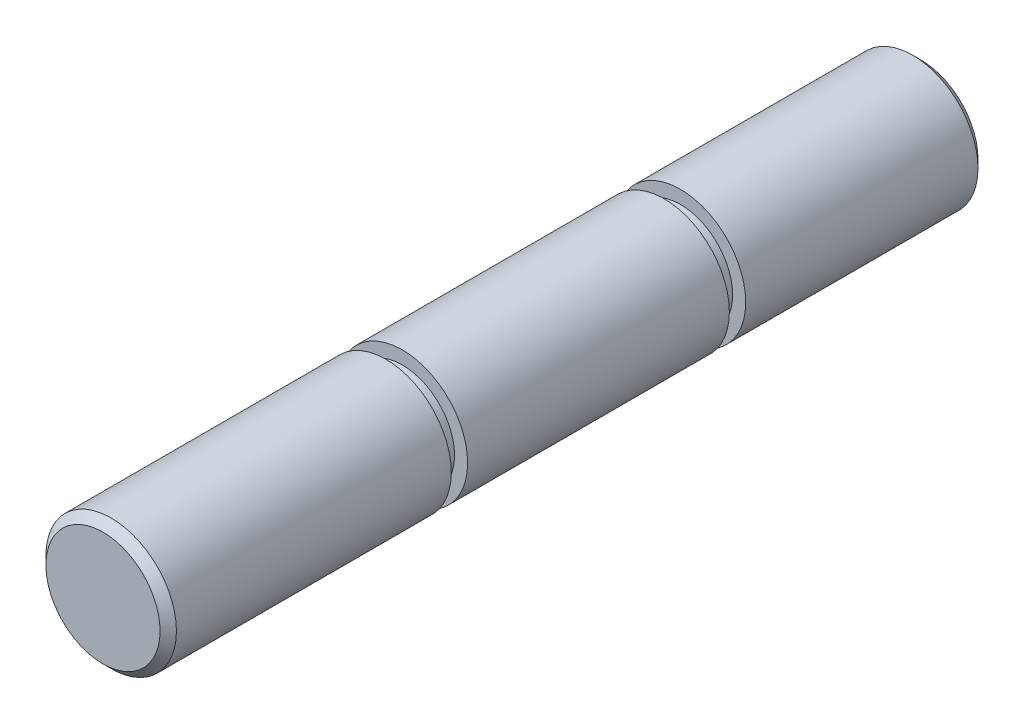
ISO-10303-21;
HEADER;
FILE_DESCRIPTION(('STEP AP214'),'2;1');
FILE_NAME('part.step','',(''),(''),'','','');
FILE_SCHEMA(('AUTOMOTIVE_DESIGN { 1 0 10303 214 1 1 1 1 }'));
ENDSEC;
DATA;
#1=APPLICATION_CONTEXT('core data for automotive mechanical design processes');
#2=APPLICATION_PROTOCOL_DEFINITION('international standard','automotive_design',2000,#1);
#3=PRODUCT_CONTEXT('',#1,'mechanical');
#4=PRODUCT('Part','Part','',(#3));
#5=PRODUCT_RELATED_PRODUCT_CATEGORY('part','',(#4));
#6=PRODUCT_DEFINITION_FORMATION('','',#4);
#7=PRODUCT_DEFINITION_CONTEXT('part definition',#1,'design');
#8=PRODUCT_DEFINITION('design','',#6,#7);
#9=PRODUCT_DEFINITION_SHAPE('','',#8);
#10=(LENGTH_UNIT() NAMED_UNIT(*) SI_UNIT(.MILLI.,.METRE.));
#11=(NAMED_UNIT(*) PLANE_ANGLE_UNIT() SI_UNIT($,.RADIAN.));
#12=(NAMED_UNIT(*) SI_UNIT($,.STERADIAN.) SOLID_ANGLE_UNIT());
#13=UNCERTAINTY_MEASURE_WITH_UNIT(LENGTH_MEASURE(1.E-05),#10,'distance_accuracy_value','');
#14=(GEOMETRIC_REPRESENTATION_CONTEXT(3) GLOBAL_UNCERTAINTY_ASSIGNED_CONTEXT((#13)) GLOBAL_UNIT_ASSIGNED_CONTEXT((#10,
#11,#12)) REPRESENTATION_CONTEXT('',''));
#15=CARTESIAN_POINT('',(0.,0.,0.));
#16=DIRECTION('',(0.,0.,1.));
#17=DIRECTION('',(1.,0.,0.));
#18=AXIS2_PLACEMENT_3D('',#15,#16,#17);
#19=CARTESIAN_POINT('',(0.,0.,50.));
#20=DIRECTION('',(0.,0.,-1.));
#21=DIRECTION('',(-1.,0.,0.));
#22=AXIS2_PLACEMENT_3D('',#19,#20,#21);
#23=CYLINDRICAL_SURFACE('',#22,3.99);
#24=CARTESIAN_POINT('',(0.,0.,0.499999999999994));
#25=DIRECTION('',(0.,0.,1.));
#26=DIRECTION('',(1.,0.,0.));
#27=AXIS2_PLACEMENT_3D('',#24,#25,#26);
#28=CIRCLE('',#27,3.99);
#29=CARTESIAN_POINT('',(3.99,0.,0.499999999999994));
#30=VERTEX_POINT('',#29);
#31=EDGE_CURVE('E45',#30,#30,#28,.T.);
#32=ORIENTED_EDGE('',*,*,#31,.T.);
#33=EDGE_LOOP('',(#32));
#34=FACE_BOUND('',#33,.T.);
#35=CARTESIAN_POINT('',(0.,0.,14.7));
#36=DIRECTION('',(0.,0.,1.));
#37=DIRECTION('',(1.,0.,0.));
#38=AXIS2_PLACEMENT_3D('',#35,#36,#37);
#39=CIRCLE('',#38,3.99);
#40=CARTESIAN_POINT('',(3.99,0.,14.7));
#41=VERTEX_POINT('',#40);
#42=EDGE_CURVE('E66',#41,#41,#39,.T.);
#43=ORIENTED_EDGE('',*,*,#42,.F.);
#44=EDGE_LOOP('',(#43));
#45=FACE_BOUND('',#44,.T.);
#46=ADVANCED_FACE('F37',(#34,#45),#23,.T.);
#47=CARTESIAN_POINT('',(0.,0.,0.));
#48=DIRECTION('',(0.,0.,1.));
#49=DIRECTION('',(1.,0.,0.));
#50=AXIS2_PLACEMENT_3D('',#47,#48,#49);
#51=PLANE('',#50);
#52=CARTESIAN_POINT('',(0.,0.,0.));
#53=DIRECTION('',(0.,0.,1.));
#54=DIRECTION('',(1.,0.,0.));
#55=AXIS2_PLACEMENT_3D('',#52,#53,#54);
#56=CIRCLE('',#55,3.49);
#57=CARTESIAN_POINT('',(3.49,0.,0.));
#58=VERTEX_POINT('',#57);
#59=EDGE_CURVE('E10',#58,#58,#56,.F.);
#60=ORIENTED_EDGE('',*,*,#59,.T.);
#61=EDGE_LOOP('',(#60));
#62=FACE_BOUND('',#61,.T.);
#63=ADVANCED_FACE('F98',(#62),#51,.F.);
#64=CARTESIAN_POINT('',(0.,3.99,14.7));
#65=DIRECTION('',(0.,0.,1.));
#66=DIRECTION('',(1.,0.,0.));
#67=AXIS2_PLACEMENT_3D('',#64,#65,#66);
#68=PLANE('',#67);
#69=ORIENTED_EDGE('',*,*,#42,.T.);
#70=EDGE_LOOP('',(#69));
#71=FACE_BOUND('',#70,.T.);
#72=CARTESIAN_POINT('',(0.,0.,14.7));
#73=DIRECTION('',(0.,0.,1.));
#74=DIRECTION('',(1.,0.,0.));
#75=AXIS2_PLACEMENT_3D('',#72,#73,#74);
#76=CIRCLE('',#75,3.19);
#77=CARTESIAN_POINT('',(3.19,0.,14.7));
#78=VERTEX_POINT('',#77);
#79=EDGE_CURVE('E61',#78,#78,#76,.T.);
#80=ORIENTED_EDGE('',*,*,#79,.F.);
#81=EDGE_LOOP('',(#80));
#82=FACE_BOUND('',#81,.T.);
#83=ADVANCED_FACE('F94',(#71,#82),#68,.T.);
#84=CARTESIAN_POINT('',(0.,0.,50.));
#85=DIRECTION('',(0.,0.,1.));
#86=DIRECTION('',(1.,0.,0.));
#87=AXIS2_PLACEMENT_3D('',#84,#85,#86);
#88=CYLINDRICAL_SURFACE('',#87,3.19);
#89=ORIENTED_EDGE('',*,*,#79,.T.);
#90=EDGE_LOOP('',(#89));
#91=FACE_BOUND('',#90,.T.);
#92=CARTESIAN_POINT('',(0.,0.,15.7));
#93=DIRECTION('',(0.,0.,1.));
#94=DIRECTION('',(1.,0.,0.));
#95=AXIS2_PLACEMENT_3D('',#92,#93,#94);
#96=CIRCLE('',#95,3.19);
#97=CARTESIAN_POINT('',(3.19,0.,15.7));
#98=VERTEX_POINT('',#97);
#99=EDGE_CURVE('E82',#98,#98,#96,.T.);
#100=ORIENTED_EDGE('',*,*,#99,.F.);
#101=EDGE_LOOP('',(#100));
#102=FACE_BOUND('',#101,.T.);
#103=ADVANCED_FACE('F151',(#91,#102),#88,.T.);
#104=CARTESIAN_POINT('',(0.,3.99,15.7));
#105=DIRECTION('',(0.,0.,-1.));
#106=DIRECTION('',(-1.,0.,0.));
#107=AXIS2_PLACEMENT_3D('',#104,#105,#106);
#108=PLANE('',#107);
#109=ORIENTED_EDGE('',*,*,#99,.T.);
#110=EDGE_LOOP('',(#109));
#111=FACE_BOUND('',#110,.T.);
#112=CARTESIAN_POINT('',(0.,0.,15.7));
#113=DIRECTION('',(0.,0.,1.));
#114=DIRECTION('',(1.,0.,0.));
#115=AXIS2_PLACEMENT_3D('',#112,#113,#114);
#116=CIRCLE('',#115,3.99);
#117=CARTESIAN_POINT('',(3.99,0.,15.7));
#118=VERTEX_POINT('',#117);
#119=EDGE_CURVE('E86',#118,#118,#116,.T.);
#120=ORIENTED_EDGE('',*,*,#119,.F.);
#121=EDGE_LOOP('',(#120));
#122=FACE_BOUND('',#121,.T.);
#123=ADVANCED_FACE('F108',(#111,#122),#108,.T.);
#124=CARTESIAN_POINT('',(0.,0.,31.7));
#125=DIRECTION('',(0.,0.,1.));
#126=DIRECTION('',(1.,0.,0.));
#127=AXIS2_PLACEMENT_3D('',#124,#125,#126);
#128=CIRCLE('',#127,3.99);
#129=CARTESIAN_POINT('',(3.99,0.,31.7));
#130=VERTEX_POINT('',#129);
#131=EDGE_CURVE('E75',#130,#130,#128,.T.);
#132=ORIENTED_EDGE('',*,*,#131,.F.);
#133=EDGE_LOOP('',(#132));
#134=FACE_BOUND('',#133,.T.);
#135=ORIENTED_EDGE('',*,*,#119,.T.);
#136=EDGE_LOOP('',(#135));
#137=FACE_BOUND('',#136,.T.);
#138=ADVANCED_FACE('F100',(#134,#137),#23,.T.);
#139=CARTESIAN_POINT('',(0.,3.99,31.7));
#140=DIRECTION('',(0.,0.,1.));
#141=DIRECTION('',(1.,0.,0.));
#142=AXIS2_PLACEMENT_3D('',#139,#140,#141);
#143=PLANE('',#142);
#144=ORIENTED_EDGE('',*,*,#131,.T.);
#145=EDGE_LOOP('',(#144));
#146=FACE_BOUND('',#145,.T.);
#147=CARTESIAN_POINT('',(0.,0.,31.7));
#148=DIRECTION('',(0.,0.,1.));
#149=DIRECTION('',(1.,0.,0.));
#150=AXIS2_PLACEMENT_3D('',#147,#148,#149);
#151=CIRCLE('',#150,3.19);
#152=CARTESIAN_POINT('',(3.19,0.,31.7));
#153=VERTEX_POINT('',#152);
#154=EDGE_CURVE('E62',#153,#153,#151,.T.);
#155=ORIENTED_EDGE('',*,*,#154,.F.);
#156=EDGE_LOOP('',(#155));
#157=FACE_BOUND('',#156,.T.);
#158=ADVANCED_FACE('F107',(#146,#157),#143,.T.);
#159=CARTESIAN_POINT('',(0.,0.,50.));
#160=DIRECTION('',(0.,0.,1.));
#161=DIRECTION('',(1.,0.,0.));
#162=AXIS2_PLACEMENT_3D('',#159,#160,#161);
#163=CYLINDRICAL_SURFACE('',#162,3.19);
#164=ORIENTED_EDGE('',*,*,#154,.T.);
#165=EDGE_LOOP('',(#164));
#166=FACE_BOUND('',#165,.T.);
#167=CARTESIAN_POINT('',(0.,0.,32.7));
#168=DIRECTION('',(0.,0.,1.));
#169=DIRECTION('',(1.,0.,0.));
#170=AXIS2_PLACEMENT_3D('',#167,#168,#169);
#171=CIRCLE('',#170,3.19);
#172=CARTESIAN_POINT('',(3.19,0.,32.7));
#173=VERTEX_POINT('',#172);
#174=EDGE_CURVE('E67',#173,#173,#171,.T.);
#175=ORIENTED_EDGE('',*,*,#174,.F.);
#176=EDGE_LOOP('',(#175));
#177=FACE_BOUND('',#176,.T.);
#178=ADVANCED_FACE('F127',(#166,#177),#163,.T.);
#179=CARTESIAN_POINT('',(0.,3.99,32.7));
#180=DIRECTION('',(0.,0.,-1.));
#181=DIRECTION('',(-1.,0.,0.));
#182=AXIS2_PLACEMENT_3D('',#179,#180,#181);
#183=PLANE('',#182);
#184=ORIENTED_EDGE('',*,*,#174,.T.);
#185=EDGE_LOOP('',(#184));
#186=FACE_BOUND('',#185,.T.);
#187=CARTESIAN_POINT('',(0.,0.,32.7));
#188=DIRECTION('',(0.,0.,1.));
#189=DIRECTION('',(1.,0.,0.));
#190=AXIS2_PLACEMENT_3D('',#187,#188,#189);
#191=CIRCLE('',#190,3.99);
#192=CARTESIAN_POINT('',(3.99,0.,32.7));
#193=VERTEX_POINT('',#192);
#194=EDGE_CURVE('E71',#193,#193,#191,.T.);
#195=ORIENTED_EDGE('',*,*,#194,.F.);
#196=EDGE_LOOP('',(#195));
#197=FACE_BOUND('',#196,.T.);
#198=ADVANCED_FACE('F119',(#186,#197),#183,.T.);
#199=CARTESIAN_POINT('',(0.,0.,50.));
#200=DIRECTION('',(0.,0.,1.));
#201=DIRECTION('',(1.,0.,0.));
#202=AXIS2_PLACEMENT_3D('',#199,#200,#201);
#203=PLANE('',#202);
#204=CARTESIAN_POINT('',(0.,0.,50.));
#205=DIRECTION('',(0.,0.,1.));
#206=DIRECTION('',(1.,0.,0.));
#207=AXIS2_PLACEMENT_3D('',#204,#205,#206);
#208=CIRCLE('',#207,3.49);
#209=CARTESIAN_POINT('',(3.49,0.,50.));
#210=VERTEX_POINT('',#209);
#211=EDGE_CURVE('E55',#210,#210,#208,.T.);
#212=ORIENTED_EDGE('',*,*,#211,.T.);
#213=EDGE_LOOP('',(#212));
#214=FACE_BOUND('',#213,.T.);
#215=ADVANCED_FACE('F112',(#214),#203,.T.);
#216=CARTESIAN_POINT('',(0.,0.,49.5));
#217=DIRECTION('',(0.,0.,1.));
#218=DIRECTION('',(1.,0.,0.));
#219=AXIS2_PLACEMENT_3D('',#216,#217,#218);
#220=CIRCLE('',#219,3.99);
#221=CARTESIAN_POINT('',(3.99,0.,49.5));
#222=VERTEX_POINT('',#221);
#223=EDGE_CURVE('E50',#222,#222,#220,.F.);
#224=ORIENTED_EDGE('',*,*,#223,.T.);
#225=EDGE_LOOP('',(#224));
#226=FACE_BOUND('',#225,.T.);
#227=ORIENTED_EDGE('',*,*,#194,.T.);
#228=EDGE_LOOP('',(#227));
#229=FACE_BOUND('',#228,.T.);
#230=ADVANCED_FACE('F101',(#226,#229),#23,.T.);
#231=CARTESIAN_POINT('',(0.,0.,50.));
#232=DIRECTION('',(0.,0.,-1.));
#233=DIRECTION('',(-1.,0.,0.));
#234=AXIS2_PLACEMENT_3D('',#231,#232,#233);
#235=CONICAL_SURFACE('',#234,3.49,0.785398163397448);
#236=ORIENTED_EDGE('',*,*,#223,.F.);
#237=EDGE_LOOP('',(#236));
#238=FACE_BOUND('',#237,.T.);
#239=ORIENTED_EDGE('',*,*,#211,.F.);
#240=EDGE_LOOP('',(#239));
#241=FACE_BOUND('',#240,.T.);
#242=ADVANCED_FACE('F111',(#238,#241),#235,.T.);
#243=CARTESIAN_POINT('',(0.,0.,0.499999999999994));
#244=DIRECTION('',(0.,0.,1.));
#245=DIRECTION('',(1.,0.,0.));
#246=AXIS2_PLACEMENT_3D('',#243,#244,#245);
#247=CONICAL_SURFACE('',#246,3.99,0.785398163397455);
#248=ORIENTED_EDGE('',*,*,#59,.F.);
#249=EDGE_LOOP('',(#248));
#250=FACE_BOUND('',#249,.T.);
#251=ORIENTED_EDGE('',*,*,#31,.F.);
#252=EDGE_LOOP('',(#251));
#253=FACE_BOUND('',#252,.T.);
#254=ADVANCED_FACE('F39',(#250,#253),#247,.T.);
#255=CLOSED_SHELL('',(#46,#63,#83,#103,#123,#138,#158,#178,#198,#215,#230,#242,#254));
#256=MANIFOLD_SOLID_BREP('B2',#255);
#257=ADVANCED_BREP_SHAPE_REPRESENTATION('',(#18,#256),#14);
#258=SHAPE_DEFINITION_REPRESENTATION(#9,#257);
ENDSEC;
END-ISO-10303-21;
